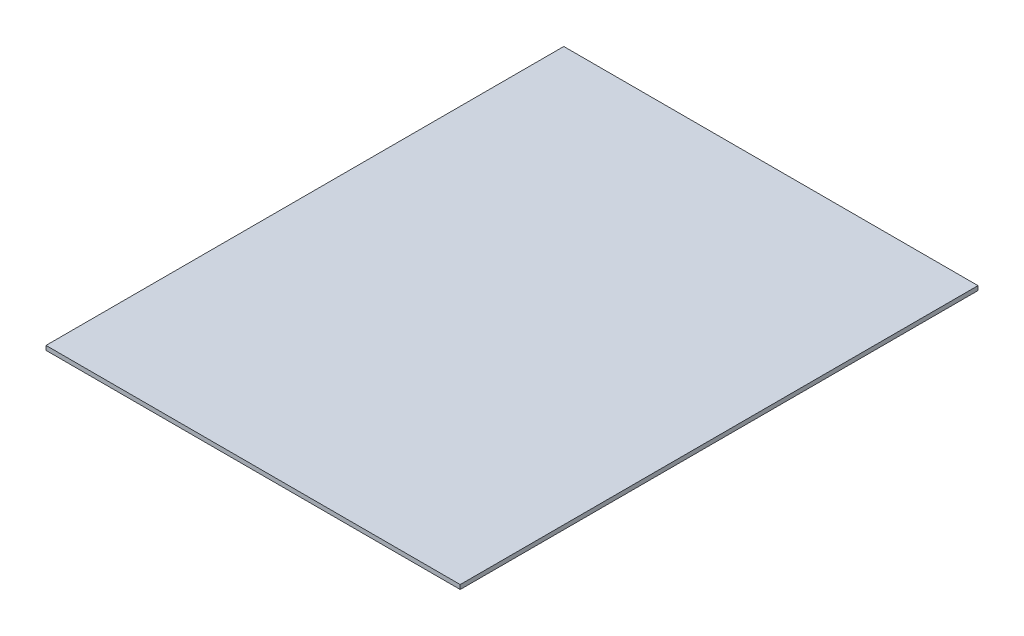
ISO-10303-21;
HEADER;
FILE_DESCRIPTION(('STEP AP214'),'2;1');
FILE_NAME('part.step','',(''),(''),'','','');
FILE_SCHEMA(('AUTOMOTIVE_DESIGN { 1 0 10303 214 1 1 1 1 }'));
ENDSEC;
DATA;
#1=APPLICATION_CONTEXT('core data for automotive mechanical design processes');
#2=APPLICATION_PROTOCOL_DEFINITION('international standard','automotive_design',2000,#1);
#3=PRODUCT_CONTEXT('',#1,'mechanical');
#4=PRODUCT('Part','Part','',(#3));
#5=PRODUCT_RELATED_PRODUCT_CATEGORY('part','',(#4));
#6=PRODUCT_DEFINITION_FORMATION('','',#4);
#7=PRODUCT_DEFINITION_CONTEXT('part definition',#1,'design');
#8=PRODUCT_DEFINITION('design','',#6,#7);
#9=PRODUCT_DEFINITION_SHAPE('','',#8);
#10=(LENGTH_UNIT() NAMED_UNIT(*) SI_UNIT(.MILLI.,.METRE.));
#11=(NAMED_UNIT(*) PLANE_ANGLE_UNIT() SI_UNIT($,.RADIAN.));
#12=(NAMED_UNIT(*) SI_UNIT($,.STERADIAN.) SOLID_ANGLE_UNIT());
#13=UNCERTAINTY_MEASURE_WITH_UNIT(LENGTH_MEASURE(1.E-05),#10,'distance_accuracy_value','');
#14=(GEOMETRIC_REPRESENTATION_CONTEXT(3) GLOBAL_UNCERTAINTY_ASSIGNED_CONTEXT((#13)) GLOBAL_UNIT_ASSIGNED_CONTEXT((#10,
#11,#12)) REPRESENTATION_CONTEXT('',''));
#15=CARTESIAN_POINT('',(0.,0.,0.));
#16=DIRECTION('',(0.,0.,1.));
#17=DIRECTION('',(1.,0.,0.));
#18=AXIS2_PLACEMENT_3D('',#15,#16,#17);
#19=CARTESIAN_POINT('',(0.,6.35,0.));
#20=DIRECTION('',(1.,0.,0.));
#21=DIRECTION('',(0.,0.,-1.));
#22=AXIS2_PLACEMENT_3D('',#19,#20,#21);
#23=PLANE('',#22);
#24=DIRECTION('',(0.,0.,1.));
#25=VECTOR('',#24,1.);
#26=CARTESIAN_POINT('',(0.,0.,0.));
#27=LINE('',#26,#25);
#28=CARTESIAN_POINT('',(0.,0.,-762.));
#29=VERTEX_POINT('',#28);
#30=CARTESIAN_POINT('',(0.,0.,0.));
#31=VERTEX_POINT('',#30);
#32=EDGE_CURVE('E98',#29,#31,#27,.T.);
#33=ORIENTED_EDGE('',*,*,#32,.T.);
#34=DIRECTION('',(0.,-1.,0.));
#35=VECTOR('',#34,1.);
#36=CARTESIAN_POINT('',(0.,6.35,0.));
#37=LINE('',#36,#35);
#38=CARTESIAN_POINT('',(0.,6.35,0.));
#39=VERTEX_POINT('',#38);
#40=EDGE_CURVE('E11',#39,#31,#37,.T.);
#41=ORIENTED_EDGE('',*,*,#40,.F.);
#42=DIRECTION('',(0.,0.,1.));
#43=VECTOR('',#42,1.);
#44=CARTESIAN_POINT('',(0.,6.35,0.));
#45=LINE('',#44,#43);
#46=CARTESIAN_POINT('',(0.,6.35,-762.));
#47=VERTEX_POINT('',#46);
#48=EDGE_CURVE('E86',#47,#39,#45,.T.);
#49=ORIENTED_EDGE('',*,*,#48,.F.);
#50=DIRECTION('',(0.,-1.,0.));
#51=VECTOR('',#50,1.);
#52=CARTESIAN_POINT('',(0.,6.35,-762.));
#53=LINE('',#52,#51);
#54=EDGE_CURVE('E94',#47,#29,#53,.T.);
#55=ORIENTED_EDGE('',*,*,#54,.T.);
#56=EDGE_LOOP('',(#33,#41,#49,#55));
#57=FACE_BOUND('',#56,.T.);
#58=ADVANCED_FACE('F35',(#57),#23,.F.);
#59=CARTESIAN_POINT('',(0.,6.35,0.));
#60=DIRECTION('',(0.,0.,-1.));
#61=DIRECTION('',(-1.,0.,0.));
#62=AXIS2_PLACEMENT_3D('',#59,#60,#61);
#63=PLANE('',#62);
#64=DIRECTION('',(1.,0.,0.));
#65=VECTOR('',#64,1.);
#66=CARTESIAN_POINT('',(0.,0.,0.));
#67=LINE('',#66,#65);
#68=CARTESIAN_POINT('',(609.6,0.,0.));
#69=VERTEX_POINT('',#68);
#70=EDGE_CURVE('E90',#31,#69,#67,.T.);
#71=ORIENTED_EDGE('',*,*,#70,.T.);
#72=DIRECTION('',(0.,-1.,0.));
#73=VECTOR('',#72,1.);
#74=CARTESIAN_POINT('',(609.6,6.35,0.));
#75=LINE('',#74,#73);
#76=CARTESIAN_POINT('',(609.6,6.35,0.));
#77=VERTEX_POINT('',#76);
#78=EDGE_CURVE('E43',#77,#69,#75,.T.);
#79=ORIENTED_EDGE('',*,*,#78,.F.);
#80=DIRECTION('',(1.,0.,0.));
#81=VECTOR('',#80,1.);
#82=CARTESIAN_POINT('',(0.,6.35,0.));
#83=LINE('',#82,#81);
#84=EDGE_CURVE('E81',#39,#77,#83,.T.);
#85=ORIENTED_EDGE('',*,*,#84,.F.);
#86=ORIENTED_EDGE('',*,*,#40,.T.);
#87=EDGE_LOOP('',(#71,#79,#85,#86));
#88=FACE_BOUND('',#87,.T.);
#89=ADVANCED_FACE('F89',(#88),#63,.F.);
#90=CARTESIAN_POINT('',(609.6,6.35,0.));
#91=DIRECTION('',(-1.,0.,0.));
#92=DIRECTION('',(0.,0.,1.));
#93=AXIS2_PLACEMENT_3D('',#90,#91,#92);
#94=PLANE('',#93);
#95=DIRECTION('',(0.,0.,-1.));
#96=VECTOR('',#95,1.);
#97=CARTESIAN_POINT('',(609.6,0.,0.));
#98=LINE('',#97,#96);
#99=CARTESIAN_POINT('',(609.6,0.,-762.));
#100=VERTEX_POINT('',#99);
#101=EDGE_CURVE('E68',#69,#100,#98,.T.);
#102=ORIENTED_EDGE('',*,*,#101,.T.);
#103=DIRECTION('',(0.,-1.,0.));
#104=VECTOR('',#103,1.);
#105=CARTESIAN_POINT('',(609.6,6.35,-762.));
#106=LINE('',#105,#104);
#107=CARTESIAN_POINT('',(609.6,6.35,-762.));
#108=VERTEX_POINT('',#107);
#109=EDGE_CURVE('E91',#108,#100,#106,.T.);
#110=ORIENTED_EDGE('',*,*,#109,.F.);
#111=DIRECTION('',(0.,0.,-1.));
#112=VECTOR('',#111,1.);
#113=CARTESIAN_POINT('',(609.6,6.35,0.));
#114=LINE('',#113,#112);
#115=EDGE_CURVE('E84',#77,#108,#114,.T.);
#116=ORIENTED_EDGE('',*,*,#115,.F.);
#117=ORIENTED_EDGE('',*,*,#78,.T.);
#118=EDGE_LOOP('',(#102,#110,#116,#117));
#119=FACE_BOUND('',#118,.T.);
#120=ADVANCED_FACE('F92',(#119),#94,.F.);
#121=CARTESIAN_POINT('',(0.,6.35,-762.));
#122=DIRECTION('',(0.,0.,1.));
#123=DIRECTION('',(1.,0.,0.));
#124=AXIS2_PLACEMENT_3D('',#121,#122,#123);
#125=PLANE('',#124);
#126=DIRECTION('',(-1.,0.,0.));
#127=VECTOR('',#126,1.);
#128=CARTESIAN_POINT('',(0.,0.,-762.));
#129=LINE('',#128,#127);
#130=EDGE_CURVE('E74',#100,#29,#129,.T.);
#131=ORIENTED_EDGE('',*,*,#130,.T.);
#132=ORIENTED_EDGE('',*,*,#54,.F.);
#133=DIRECTION('',(-1.,0.,0.));
#134=VECTOR('',#133,1.);
#135=CARTESIAN_POINT('',(0.,6.35,-762.));
#136=LINE('',#135,#134);
#137=EDGE_CURVE('E51',#108,#47,#136,.T.);
#138=ORIENTED_EDGE('',*,*,#137,.F.);
#139=ORIENTED_EDGE('',*,*,#109,.T.);
#140=EDGE_LOOP('',(#131,#132,#138,#139));
#141=FACE_BOUND('',#140,.T.);
#142=ADVANCED_FACE('F105',(#141),#125,.F.);
#143=CARTESIAN_POINT('',(0.,6.35,0.));
#144=DIRECTION('',(0.,-1.,0.));
#145=DIRECTION('',(0.,0.,-1.));
#146=AXIS2_PLACEMENT_3D('',#143,#144,#145);
#147=PLANE('',#146);
#148=ORIENTED_EDGE('',*,*,#48,.T.);
#149=ORIENTED_EDGE('',*,*,#84,.T.);
#150=ORIENTED_EDGE('',*,*,#115,.T.);
#151=ORIENTED_EDGE('',*,*,#137,.T.);
#152=EDGE_LOOP('',(#148,#149,#150,#151));
#153=FACE_BOUND('',#152,.T.);
#154=ADVANCED_FACE('F82',(#153),#147,.F.);
#155=CARTESIAN_POINT('',(0.,0.,0.));
#156=DIRECTION('',(0.,-1.,0.));
#157=DIRECTION('',(0.,0.,-1.));
#158=AXIS2_PLACEMENT_3D('',#155,#156,#157);
#159=PLANE('',#158);
#160=ORIENTED_EDGE('',*,*,#32,.F.);
#161=ORIENTED_EDGE('',*,*,#130,.F.);
#162=ORIENTED_EDGE('',*,*,#101,.F.);
#163=ORIENTED_EDGE('',*,*,#70,.F.);
#164=EDGE_LOOP('',(#160,#161,#162,#163));
#165=FACE_BOUND('',#164,.T.);
#166=ADVANCED_FACE('F108',(#165),#159,.T.);
#167=CLOSED_SHELL('',(#58,#89,#120,#142,#154,#166));
#168=MANIFOLD_SOLID_BREP('B2',#167);
#169=ADVANCED_BREP_SHAPE_REPRESENTATION('',(#18,#168),#14);
#170=SHAPE_DEFINITION_REPRESENTATION(#9,#169);
ENDSEC;
END-ISO-10303-21;
